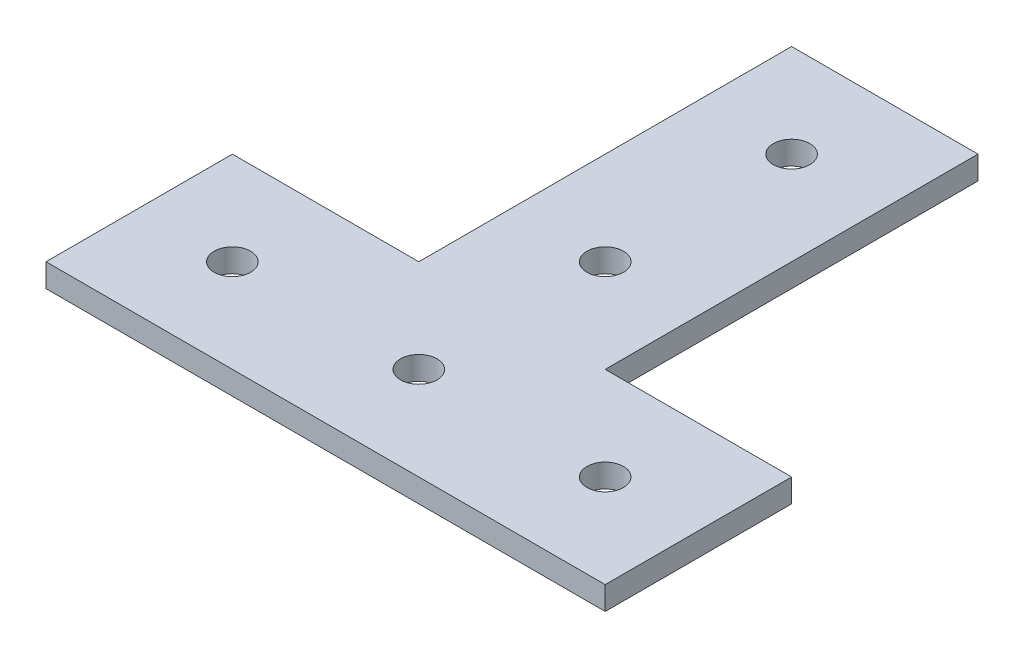
ISO-10303-21;
HEADER;
FILE_DESCRIPTION(('STEP AP214'),'2;1');
FILE_NAME('part.step','',(''),(''),'','','');
FILE_SCHEMA(('AUTOMOTIVE_DESIGN { 1 0 10303 214 1 1 1 1 }'));
ENDSEC;
DATA;
#1=APPLICATION_CONTEXT('core data for automotive mechanical design processes');
#2=APPLICATION_PROTOCOL_DEFINITION('international standard','automotive_design',2000,#1);
#3=PRODUCT_CONTEXT('',#1,'mechanical');
#4=PRODUCT('Part','Part','',(#3));
#5=PRODUCT_RELATED_PRODUCT_CATEGORY('part','',(#4));
#6=PRODUCT_DEFINITION_FORMATION('','',#4);
#7=PRODUCT_DEFINITION_CONTEXT('part definition',#1,'design');
#8=PRODUCT_DEFINITION('design','',#6,#7);
#9=PRODUCT_DEFINITION_SHAPE('','',#8);
#10=(LENGTH_UNIT() NAMED_UNIT(*) SI_UNIT(.MILLI.,.METRE.));
#11=(NAMED_UNIT(*) PLANE_ANGLE_UNIT() SI_UNIT($,.RADIAN.));
#12=(NAMED_UNIT(*) SI_UNIT($,.STERADIAN.) SOLID_ANGLE_UNIT());
#13=UNCERTAINTY_MEASURE_WITH_UNIT(LENGTH_MEASURE(1.E-05),#10,'distance_accuracy_value','');
#14=(GEOMETRIC_REPRESENTATION_CONTEXT(3) GLOBAL_UNCERTAINTY_ASSIGNED_CONTEXT((#13)) GLOBAL_UNIT_ASSIGNED_CONTEXT((#10,
#11,#12)) REPRESENTATION_CONTEXT('',''));
#15=CARTESIAN_POINT('',(0.,0.,0.));
#16=DIRECTION('',(0.,0.,1.));
#17=DIRECTION('',(1.,0.,0.));
#18=AXIS2_PLACEMENT_3D('',#15,#16,#17);
#19=CARTESIAN_POINT('',(0.,3.175,0.));
#20=DIRECTION('',(0.,-1.,0.));
#21=DIRECTION('',(0.,0.,-1.));
#22=AXIS2_PLACEMENT_3D('',#19,#20,#21);
#23=PLANE('',#22);
#24=DIRECTION('',(0.,0.,1.));
#25=VECTOR('',#24,1.);
#26=CARTESIAN_POINT('',(-38.1,3.175,0.));
#27=LINE('',#26,#25);
#28=CARTESIAN_POINT('',(-38.1,3.175,-25.4));
#29=VERTEX_POINT('',#28);
#30=CARTESIAN_POINT('',(-38.1,3.175,0.));
#31=VERTEX_POINT('',#30);
#32=EDGE_CURVE('E146',#29,#31,#27,.T.);
#33=ORIENTED_EDGE('',*,*,#32,.T.);
#34=DIRECTION('',(1.,0.,0.));
#35=VECTOR('',#34,1.);
#36=CARTESIAN_POINT('',(38.1,3.175,0.));
#37=LINE('',#36,#35);
#38=CARTESIAN_POINT('',(38.1,3.175,0.));
#39=VERTEX_POINT('',#38);
#40=EDGE_CURVE('E94',#31,#39,#37,.T.);
#41=ORIENTED_EDGE('',*,*,#40,.T.);
#42=DIRECTION('',(0.,0.,-1.));
#43=VECTOR('',#42,1.);
#44=CARTESIAN_POINT('',(38.1,3.175,-25.4));
#45=LINE('',#44,#43);
#46=CARTESIAN_POINT('',(38.1,3.175,-25.4));
#47=VERTEX_POINT('',#46);
#48=EDGE_CURVE('E161',#39,#47,#45,.T.);
#49=ORIENTED_EDGE('',*,*,#48,.T.);
#50=DIRECTION('',(-1.,0.,0.));
#51=VECTOR('',#50,1.);
#52=CARTESIAN_POINT('',(12.7,3.175,-25.4));
#53=LINE('',#52,#51);
#54=CARTESIAN_POINT('',(12.7,3.175,-25.4));
#55=VERTEX_POINT('',#54);
#56=EDGE_CURVE('E174',#47,#55,#53,.T.);
#57=ORIENTED_EDGE('',*,*,#56,.T.);
#58=DIRECTION('',(0.,0.,-1.));
#59=VECTOR('',#58,1.);
#60=CARTESIAN_POINT('',(12.7,3.175,-76.2));
#61=LINE('',#60,#59);
#62=CARTESIAN_POINT('',(12.7,3.175,-76.2));
#63=VERTEX_POINT('',#62);
#64=EDGE_CURVE('E113',#55,#63,#61,.T.);
#65=ORIENTED_EDGE('',*,*,#64,.T.);
#66=DIRECTION('',(-1.,0.,0.));
#67=VECTOR('',#66,1.);
#68=CARTESIAN_POINT('',(-12.7,3.175,-76.2));
#69=LINE('',#68,#67);
#70=CARTESIAN_POINT('',(-12.7,3.175,-76.2));
#71=VERTEX_POINT('',#70);
#72=EDGE_CURVE('E107',#63,#71,#69,.T.);
#73=ORIENTED_EDGE('',*,*,#72,.T.);
#74=DIRECTION('',(0.,0.,1.));
#75=VECTOR('',#74,1.);
#76=CARTESIAN_POINT('',(-12.7,3.175,-25.4));
#77=LINE('',#76,#75);
#78=CARTESIAN_POINT('',(-12.7,3.175,-25.4));
#79=VERTEX_POINT('',#78);
#80=EDGE_CURVE('E111',#71,#79,#77,.T.);
#81=ORIENTED_EDGE('',*,*,#80,.T.);
#82=DIRECTION('',(-1.,0.,0.));
#83=VECTOR('',#82,1.);
#84=CARTESIAN_POINT('',(-38.1,3.175,-25.4));
#85=LINE('',#84,#83);
#86=EDGE_CURVE('E51',#79,#29,#85,.T.);
#87=ORIENTED_EDGE('',*,*,#86,.T.);
#88=EDGE_LOOP('',(#33,#41,#49,#57,#65,#73,#81,#87));
#89=FACE_BOUND('',#88,.T.);
#90=CARTESIAN_POINT('',(0.,3.175,-63.5));
#91=DIRECTION('',(0.,1.,0.));
#92=DIRECTION('',(0.,0.,1.));
#93=AXIS2_PLACEMENT_3D('',#90,#91,#92);
#94=CIRCLE('',#93,2.4892);
#95=CARTESIAN_POINT('',(0.,3.175,-61.0108));
#96=VERTEX_POINT('',#95);
#97=EDGE_CURVE('E135',#96,#96,#94,.T.);
#98=ORIENTED_EDGE('',*,*,#97,.F.);
#99=EDGE_LOOP('',(#98));
#100=FACE_BOUND('',#99,.T.);
#101=CARTESIAN_POINT('',(0.,3.175,-38.1));
#102=DIRECTION('',(0.,1.,0.));
#103=DIRECTION('',(0.,0.,1.));
#104=AXIS2_PLACEMENT_3D('',#101,#102,#103);
#105=CIRCLE('',#104,2.4892);
#106=CARTESIAN_POINT('',(0.,3.175,-35.6108));
#107=VERTEX_POINT('',#106);
#108=EDGE_CURVE('E183',#107,#107,#105,.T.);
#109=ORIENTED_EDGE('',*,*,#108,.F.);
#110=EDGE_LOOP('',(#109));
#111=FACE_BOUND('',#110,.T.);
#112=CARTESIAN_POINT('',(-25.4,3.175,-12.7));
#113=DIRECTION('',(0.,1.,0.));
#114=DIRECTION('',(0.,0.,1.));
#115=AXIS2_PLACEMENT_3D('',#112,#113,#114);
#116=CIRCLE('',#115,2.4892);
#117=CARTESIAN_POINT('',(-25.4,3.175,-10.2108));
#118=VERTEX_POINT('',#117);
#119=EDGE_CURVE('E189',#118,#118,#116,.T.);
#120=ORIENTED_EDGE('',*,*,#119,.F.);
#121=EDGE_LOOP('',(#120));
#122=FACE_BOUND('',#121,.T.);
#123=CARTESIAN_POINT('',(25.4,3.175,-12.7));
#124=DIRECTION('',(0.,1.,0.));
#125=DIRECTION('',(0.,0.,1.));
#126=AXIS2_PLACEMENT_3D('',#123,#124,#125);
#127=CIRCLE('',#126,2.4892);
#128=CARTESIAN_POINT('',(25.4,3.175,-10.2108));
#129=VERTEX_POINT('',#128);
#130=EDGE_CURVE('E195',#129,#129,#127,.T.);
#131=ORIENTED_EDGE('',*,*,#130,.F.);
#132=EDGE_LOOP('',(#131));
#133=FACE_BOUND('',#132,.T.);
#134=CARTESIAN_POINT('',(0.,3.175,-12.7));
#135=DIRECTION('',(0.,1.,0.));
#136=DIRECTION('',(0.,0.,1.));
#137=AXIS2_PLACEMENT_3D('',#134,#135,#136);
#138=CIRCLE('',#137,2.4892);
#139=CARTESIAN_POINT('',(0.,3.175,-10.2108));
#140=VERTEX_POINT('',#139);
#141=EDGE_CURVE('E201',#140,#140,#138,.T.);
#142=ORIENTED_EDGE('',*,*,#141,.F.);
#143=EDGE_LOOP('',(#142));
#144=FACE_BOUND('',#143,.T.);
#145=ADVANCED_FACE('F34',(#89,#100,#111,#122,#133,#144),#23,.F.);
#146=CARTESIAN_POINT('',(0.,0.,0.));
#147=DIRECTION('',(0.,-1.,0.));
#148=DIRECTION('',(0.,0.,-1.));
#149=AXIS2_PLACEMENT_3D('',#146,#147,#148);
#150=PLANE('',#149);
#151=CARTESIAN_POINT('',(25.4,0.,-12.7));
#152=DIRECTION('',(0.,1.,0.));
#153=DIRECTION('',(0.,0.,1.));
#154=AXIS2_PLACEMENT_3D('',#151,#152,#153);
#155=CIRCLE('',#154,2.4892);
#156=CARTESIAN_POINT('',(25.4,0.,-10.2108));
#157=VERTEX_POINT('',#156);
#158=EDGE_CURVE('E198',#157,#157,#155,.T.);
#159=ORIENTED_EDGE('',*,*,#158,.T.);
#160=EDGE_LOOP('',(#159));
#161=FACE_BOUND('',#160,.T.);
#162=CARTESIAN_POINT('',(0.,0.,-38.1));
#163=DIRECTION('',(0.,1.,0.));
#164=DIRECTION('',(0.,0.,1.));
#165=AXIS2_PLACEMENT_3D('',#162,#163,#164);
#166=CIRCLE('',#165,2.4892);
#167=CARTESIAN_POINT('',(0.,0.,-35.6108));
#168=VERTEX_POINT('',#167);
#169=EDGE_CURVE('E186',#168,#168,#166,.T.);
#170=ORIENTED_EDGE('',*,*,#169,.T.);
#171=EDGE_LOOP('',(#170));
#172=FACE_BOUND('',#171,.T.);
#173=DIRECTION('',(0.,0.,1.));
#174=VECTOR('',#173,1.);
#175=CARTESIAN_POINT('',(-38.1,0.,0.));
#176=LINE('',#175,#174);
#177=CARTESIAN_POINT('',(-38.1,0.,-25.4));
#178=VERTEX_POINT('',#177);
#179=CARTESIAN_POINT('',(-38.1,0.,0.));
#180=VERTEX_POINT('',#179);
#181=EDGE_CURVE('E131',#178,#180,#176,.T.);
#182=ORIENTED_EDGE('',*,*,#181,.F.);
#183=DIRECTION('',(-1.,0.,0.));
#184=VECTOR('',#183,1.);
#185=CARTESIAN_POINT('',(-38.1,0.,-25.4));
#186=LINE('',#185,#184);
#187=CARTESIAN_POINT('',(-12.7,0.,-25.4));
#188=VERTEX_POINT('',#187);
#189=EDGE_CURVE('E86',#188,#178,#186,.T.);
#190=ORIENTED_EDGE('',*,*,#189,.F.);
#191=DIRECTION('',(0.,0.,1.));
#192=VECTOR('',#191,1.);
#193=CARTESIAN_POINT('',(-12.7,0.,-25.4));
#194=LINE('',#193,#192);
#195=CARTESIAN_POINT('',(-12.7,0.,-76.2));
#196=VERTEX_POINT('',#195);
#197=EDGE_CURVE('E80',#196,#188,#194,.T.);
#198=ORIENTED_EDGE('',*,*,#197,.F.);
#199=DIRECTION('',(-1.,0.,0.));
#200=VECTOR('',#199,1.);
#201=CARTESIAN_POINT('',(-12.7,0.,-76.2));
#202=LINE('',#201,#200);
#203=CARTESIAN_POINT('',(12.7,0.,-76.2));
#204=VERTEX_POINT('',#203);
#205=EDGE_CURVE('E121',#204,#196,#202,.T.);
#206=ORIENTED_EDGE('',*,*,#205,.F.);
#207=DIRECTION('',(0.,0.,-1.));
#208=VECTOR('',#207,1.);
#209=CARTESIAN_POINT('',(12.7,0.,-76.2));
#210=LINE('',#209,#208);
#211=CARTESIAN_POINT('',(12.7,0.,-25.4));
#212=VERTEX_POINT('',#211);
#213=EDGE_CURVE('E141',#212,#204,#210,.T.);
#214=ORIENTED_EDGE('',*,*,#213,.F.);
#215=DIRECTION('',(-1.,0.,0.));
#216=VECTOR('',#215,1.);
#217=CARTESIAN_POINT('',(12.7,0.,-25.4));
#218=LINE('',#217,#216);
#219=CARTESIAN_POINT('',(38.1,0.,-25.4));
#220=VERTEX_POINT('',#219);
#221=EDGE_CURVE('E139',#220,#212,#218,.T.);
#222=ORIENTED_EDGE('',*,*,#221,.F.);
#223=DIRECTION('',(0.,0.,-1.));
#224=VECTOR('',#223,1.);
#225=CARTESIAN_POINT('',(38.1,0.,-25.4));
#226=LINE('',#225,#224);
#227=CARTESIAN_POINT('',(38.1,0.,0.));
#228=VERTEX_POINT('',#227);
#229=EDGE_CURVE('E137',#228,#220,#226,.T.);
#230=ORIENTED_EDGE('',*,*,#229,.F.);
#231=DIRECTION('',(1.,0.,0.));
#232=VECTOR('',#231,1.);
#233=CARTESIAN_POINT('',(38.1,0.,0.));
#234=LINE('',#233,#232);
#235=EDGE_CURVE('E134',#180,#228,#234,.T.);
#236=ORIENTED_EDGE('',*,*,#235,.F.);
#237=EDGE_LOOP('',(#182,#190,#198,#206,#214,#222,#230,#236));
#238=FACE_BOUND('',#237,.T.);
#239=CARTESIAN_POINT('',(0.,0.,-63.5));
#240=DIRECTION('',(0.,1.,0.));
#241=DIRECTION('',(0.,0.,1.));
#242=AXIS2_PLACEMENT_3D('',#239,#240,#241);
#243=CIRCLE('',#242,2.4892);
#244=CARTESIAN_POINT('',(0.,0.,-61.0108));
#245=VERTEX_POINT('',#244);
#246=EDGE_CURVE('E180',#245,#245,#243,.T.);
#247=ORIENTED_EDGE('',*,*,#246,.T.);
#248=EDGE_LOOP('',(#247));
#249=FACE_BOUND('',#248,.T.);
#250=CARTESIAN_POINT('',(-25.4,0.,-12.7));
#251=DIRECTION('',(0.,1.,0.));
#252=DIRECTION('',(0.,0.,1.));
#253=AXIS2_PLACEMENT_3D('',#250,#251,#252);
#254=CIRCLE('',#253,2.4892);
#255=CARTESIAN_POINT('',(-25.4,0.,-10.2108));
#256=VERTEX_POINT('',#255);
#257=EDGE_CURVE('E192',#256,#256,#254,.T.);
#258=ORIENTED_EDGE('',*,*,#257,.T.);
#259=EDGE_LOOP('',(#258));
#260=FACE_BOUND('',#259,.T.);
#261=CARTESIAN_POINT('',(0.,0.,-12.7));
#262=DIRECTION('',(0.,1.,0.));
#263=DIRECTION('',(0.,0.,1.));
#264=AXIS2_PLACEMENT_3D('',#261,#262,#263);
#265=CIRCLE('',#264,2.4892);
#266=CARTESIAN_POINT('',(0.,0.,-10.2108));
#267=VERTEX_POINT('',#266);
#268=EDGE_CURVE('E204',#267,#267,#265,.T.);
#269=ORIENTED_EDGE('',*,*,#268,.T.);
#270=EDGE_LOOP('',(#269));
#271=FACE_BOUND('',#270,.T.);
#272=ADVANCED_FACE('F165',(#161,#172,#238,#249,#260,#271),#150,.T.);
#273=CARTESIAN_POINT('',(-38.1,3.175,0.));
#274=DIRECTION('',(1.,0.,0.));
#275=DIRECTION('',(0.,0.,-1.));
#276=AXIS2_PLACEMENT_3D('',#273,#274,#275);
#277=PLANE('',#276);
#278=ORIENTED_EDGE('',*,*,#181,.T.);
#279=DIRECTION('',(0.,-1.,0.));
#280=VECTOR('',#279,1.);
#281=CARTESIAN_POINT('',(-38.1,3.175,0.));
#282=LINE('',#281,#280);
#283=EDGE_CURVE('E11',#31,#180,#282,.T.);
#284=ORIENTED_EDGE('',*,*,#283,.F.);
#285=ORIENTED_EDGE('',*,*,#32,.F.);
#286=DIRECTION('',(0.,-1.,0.));
#287=VECTOR('',#286,1.);
#288=CARTESIAN_POINT('',(-38.1,3.175,-25.4));
#289=LINE('',#288,#287);
#290=EDGE_CURVE('E127',#29,#178,#289,.T.);
#291=ORIENTED_EDGE('',*,*,#290,.T.);
#292=EDGE_LOOP('',(#278,#284,#285,#291));
#293=FACE_BOUND('',#292,.T.);
#294=ADVANCED_FACE('F36',(#293),#277,.F.);
#295=CARTESIAN_POINT('',(38.1,3.175,0.));
#296=DIRECTION('',(0.,0.,-1.));
#297=DIRECTION('',(-1.,0.,0.));
#298=AXIS2_PLACEMENT_3D('',#295,#296,#297);
#299=PLANE('',#298);
#300=ORIENTED_EDGE('',*,*,#235,.T.);
#301=DIRECTION('',(0.,-1.,0.));
#302=VECTOR('',#301,1.);
#303=CARTESIAN_POINT('',(38.1,3.175,0.));
#304=LINE('',#303,#302);
#305=EDGE_CURVE('E43',#39,#228,#304,.T.);
#306=ORIENTED_EDGE('',*,*,#305,.F.);
#307=ORIENTED_EDGE('',*,*,#40,.F.);
#308=ORIENTED_EDGE('',*,*,#283,.T.);
#309=EDGE_LOOP('',(#300,#306,#307,#308));
#310=FACE_BOUND('',#309,.T.);
#311=ADVANCED_FACE('F236',(#310),#299,.F.);
#312=CARTESIAN_POINT('',(38.1,3.175,-25.4));
#313=DIRECTION('',(-1.,0.,0.));
#314=DIRECTION('',(0.,0.,1.));
#315=AXIS2_PLACEMENT_3D('',#312,#313,#314);
#316=PLANE('',#315);
#317=ORIENTED_EDGE('',*,*,#229,.T.);
#318=DIRECTION('',(0.,-1.,0.));
#319=VECTOR('',#318,1.);
#320=CARTESIAN_POINT('',(38.1,3.175,-25.4));
#321=LINE('',#320,#319);
#322=EDGE_CURVE('E153',#47,#220,#321,.T.);
#323=ORIENTED_EDGE('',*,*,#322,.F.);
#324=ORIENTED_EDGE('',*,*,#48,.F.);
#325=ORIENTED_EDGE('',*,*,#305,.T.);
#326=EDGE_LOOP('',(#317,#323,#324,#325));
#327=FACE_BOUND('',#326,.T.);
#328=ADVANCED_FACE('F159',(#327),#316,.F.);
#329=CARTESIAN_POINT('',(12.7,3.175,-25.4));
#330=DIRECTION('',(0.,0.,1.));
#331=DIRECTION('',(1.,0.,0.));
#332=AXIS2_PLACEMENT_3D('',#329,#330,#331);
#333=PLANE('',#332);
#334=ORIENTED_EDGE('',*,*,#221,.T.);
#335=DIRECTION('',(0.,-1.,0.));
#336=VECTOR('',#335,1.);
#337=CARTESIAN_POINT('',(12.7,3.175,-25.4));
#338=LINE('',#337,#336);
#339=EDGE_CURVE('E150',#55,#212,#338,.T.);
#340=ORIENTED_EDGE('',*,*,#339,.F.);
#341=ORIENTED_EDGE('',*,*,#56,.F.);
#342=ORIENTED_EDGE('',*,*,#322,.T.);
#343=EDGE_LOOP('',(#334,#340,#341,#342));
#344=FACE_BOUND('',#343,.T.);
#345=ADVANCED_FACE('F170',(#344),#333,.F.);
#346=CARTESIAN_POINT('',(12.7,3.175,-76.2));
#347=DIRECTION('',(-1.,0.,0.));
#348=DIRECTION('',(0.,0.,1.));
#349=AXIS2_PLACEMENT_3D('',#346,#347,#348);
#350=PLANE('',#349);
#351=ORIENTED_EDGE('',*,*,#213,.T.);
#352=DIRECTION('',(0.,-1.,0.));
#353=VECTOR('',#352,1.);
#354=CARTESIAN_POINT('',(12.7,3.175,-76.2));
#355=LINE('',#354,#353);
#356=EDGE_CURVE('E122',#63,#204,#355,.T.);
#357=ORIENTED_EDGE('',*,*,#356,.F.);
#358=ORIENTED_EDGE('',*,*,#64,.F.);
#359=ORIENTED_EDGE('',*,*,#339,.T.);
#360=EDGE_LOOP('',(#351,#357,#358,#359));
#361=FACE_BOUND('',#360,.T.);
#362=ADVANCED_FACE('F173',(#361),#350,.F.);
#363=CARTESIAN_POINT('',(-12.7,3.175,-76.2));
#364=DIRECTION('',(0.,0.,1.));
#365=DIRECTION('',(1.,0.,0.));
#366=AXIS2_PLACEMENT_3D('',#363,#364,#365);
#367=PLANE('',#366);
#368=ORIENTED_EDGE('',*,*,#205,.T.);
#369=DIRECTION('',(0.,-1.,0.));
#370=VECTOR('',#369,1.);
#371=CARTESIAN_POINT('',(-12.7,3.175,-76.2));
#372=LINE('',#371,#370);
#373=EDGE_CURVE('E118',#71,#196,#372,.T.);
#374=ORIENTED_EDGE('',*,*,#373,.F.);
#375=ORIENTED_EDGE('',*,*,#72,.F.);
#376=ORIENTED_EDGE('',*,*,#356,.T.);
#377=EDGE_LOOP('',(#368,#374,#375,#376));
#378=FACE_BOUND('',#377,.T.);
#379=ADVANCED_FACE('F119',(#378),#367,.F.);
#380=CARTESIAN_POINT('',(-12.7,3.175,-25.4));
#381=DIRECTION('',(1.,0.,0.));
#382=DIRECTION('',(0.,0.,-1.));
#383=AXIS2_PLACEMENT_3D('',#380,#381,#382);
#384=PLANE('',#383);
#385=ORIENTED_EDGE('',*,*,#197,.T.);
#386=DIRECTION('',(0.,-1.,0.));
#387=VECTOR('',#386,1.);
#388=CARTESIAN_POINT('',(-12.7,3.175,-25.4));
#389=LINE('',#388,#387);
#390=EDGE_CURVE('E123',#79,#188,#389,.T.);
#391=ORIENTED_EDGE('',*,*,#390,.F.);
#392=ORIENTED_EDGE('',*,*,#80,.F.);
#393=ORIENTED_EDGE('',*,*,#373,.T.);
#394=EDGE_LOOP('',(#385,#391,#392,#393));
#395=FACE_BOUND('',#394,.T.);
#396=ADVANCED_FACE('F125',(#395),#384,.F.);
#397=CARTESIAN_POINT('',(-38.1,3.175,-25.4));
#398=DIRECTION('',(0.,0.,1.));
#399=DIRECTION('',(1.,0.,0.));
#400=AXIS2_PLACEMENT_3D('',#397,#398,#399);
#401=PLANE('',#400);
#402=ORIENTED_EDGE('',*,*,#189,.T.);
#403=ORIENTED_EDGE('',*,*,#290,.F.);
#404=ORIENTED_EDGE('',*,*,#86,.F.);
#405=ORIENTED_EDGE('',*,*,#390,.T.);
#406=EDGE_LOOP('',(#402,#403,#404,#405));
#407=FACE_BOUND('',#406,.T.);
#408=ADVANCED_FACE('F224',(#407),#401,.F.);
#409=CARTESIAN_POINT('',(0.,3.175,-63.5));
#410=DIRECTION('',(0.,-1.,0.));
#411=DIRECTION('',(0.,0.,-1.));
#412=AXIS2_PLACEMENT_3D('',#409,#410,#411);
#413=CYLINDRICAL_SURFACE('',#412,2.4892);
#414=ORIENTED_EDGE('',*,*,#97,.T.);
#415=EDGE_LOOP('',(#414));
#416=FACE_BOUND('',#415,.T.);
#417=ORIENTED_EDGE('',*,*,#246,.F.);
#418=EDGE_LOOP('',(#417));
#419=FACE_BOUND('',#418,.T.);
#420=ADVANCED_FACE('F221',(#416,#419),#413,.F.);
#421=CARTESIAN_POINT('',(0.,3.175,-38.1));
#422=DIRECTION('',(0.,-1.,0.));
#423=DIRECTION('',(0.,0.,-1.));
#424=AXIS2_PLACEMENT_3D('',#421,#422,#423);
#425=CYLINDRICAL_SURFACE('',#424,2.4892);
#426=ORIENTED_EDGE('',*,*,#108,.T.);
#427=EDGE_LOOP('',(#426));
#428=FACE_BOUND('',#427,.T.);
#429=ORIENTED_EDGE('',*,*,#169,.F.);
#430=EDGE_LOOP('',(#429));
#431=FACE_BOUND('',#430,.T.);
#432=ADVANCED_FACE('F300',(#428,#431),#425,.F.);
#433=CARTESIAN_POINT('',(-25.4,3.175,-12.7));
#434=DIRECTION('',(0.,-1.,0.));
#435=DIRECTION('',(0.,0.,-1.));
#436=AXIS2_PLACEMENT_3D('',#433,#434,#435);
#437=CYLINDRICAL_SURFACE('',#436,2.4892);
#438=ORIENTED_EDGE('',*,*,#119,.T.);
#439=EDGE_LOOP('',(#438));
#440=FACE_BOUND('',#439,.T.);
#441=ORIENTED_EDGE('',*,*,#257,.F.);
#442=EDGE_LOOP('',(#441));
#443=FACE_BOUND('',#442,.T.);
#444=ADVANCED_FACE('F308',(#440,#443),#437,.F.);
#445=CARTESIAN_POINT('',(25.4,3.175,-12.7));
#446=DIRECTION('',(0.,-1.,0.));
#447=DIRECTION('',(0.,0.,-1.));
#448=AXIS2_PLACEMENT_3D('',#445,#446,#447);
#449=CYLINDRICAL_SURFACE('',#448,2.4892);
#450=ORIENTED_EDGE('',*,*,#130,.T.);
#451=EDGE_LOOP('',(#450));
#452=FACE_BOUND('',#451,.T.);
#453=ORIENTED_EDGE('',*,*,#158,.F.);
#454=EDGE_LOOP('',(#453));
#455=FACE_BOUND('',#454,.T.);
#456=ADVANCED_FACE('F316',(#452,#455),#449,.F.);
#457=CARTESIAN_POINT('',(0.,3.175,-12.7));
#458=DIRECTION('',(0.,-1.,0.));
#459=DIRECTION('',(0.,0.,-1.));
#460=AXIS2_PLACEMENT_3D('',#457,#458,#459);
#461=CYLINDRICAL_SURFACE('',#460,2.4892);
#462=ORIENTED_EDGE('',*,*,#141,.T.);
#463=EDGE_LOOP('',(#462));
#464=FACE_BOUND('',#463,.T.);
#465=ORIENTED_EDGE('',*,*,#268,.F.);
#466=EDGE_LOOP('',(#465));
#467=FACE_BOUND('',#466,.T.);
#468=ADVANCED_FACE('F210',(#464,#467),#461,.F.);
#469=CLOSED_SHELL('',(#145,#272,#294,#311,#328,#345,#362,#379,#396,#408,#420,#432,#444,#456,#468));
#470=MANIFOLD_SOLID_BREP('B2',#469);
#471=ADVANCED_BREP_SHAPE_REPRESENTATION('',(#18,#470),#14);
#472=SHAPE_DEFINITION_REPRESENTATION(#9,#471);
ENDSEC;
END-ISO-10303-21;
